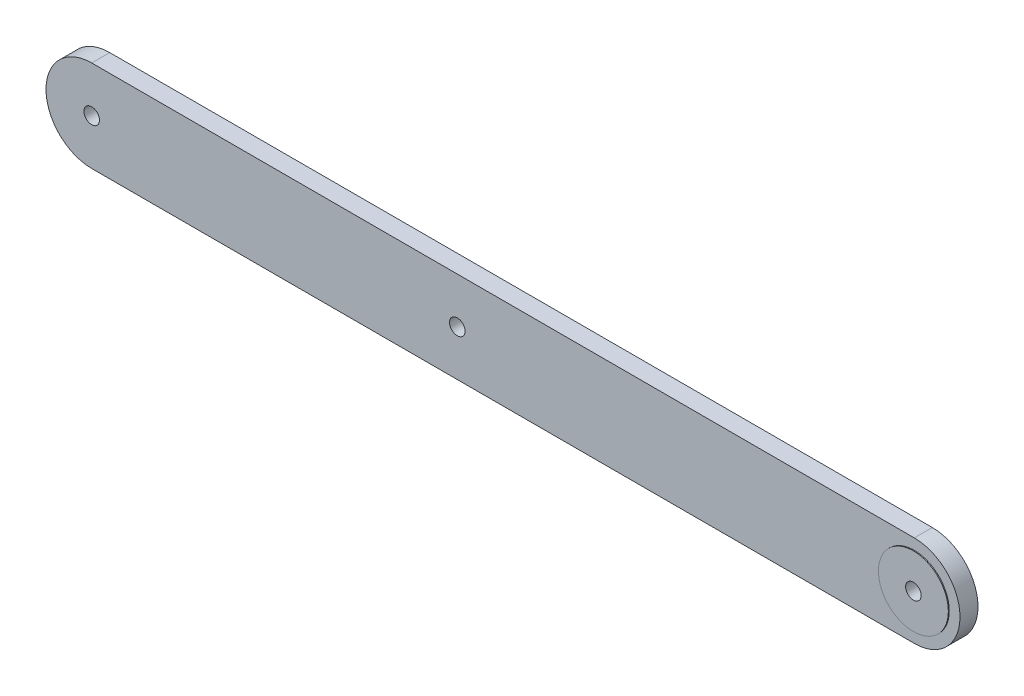
ISO-10303-21;
HEADER;
FILE_DESCRIPTION(('STEP AP214'),'2;1');
FILE_NAME('part.step','',(''),(''),'','','');
FILE_SCHEMA(('AUTOMOTIVE_DESIGN { 1 0 10303 214 1 1 1 1 }'));
ENDSEC;
DATA;
#1=APPLICATION_CONTEXT('core data for automotive mechanical design processes');
#2=APPLICATION_PROTOCOL_DEFINITION('international standard','automotive_design',2000,#1);
#3=PRODUCT_CONTEXT('',#1,'mechanical');
#4=PRODUCT('Part','Part','',(#3));
#5=PRODUCT_RELATED_PRODUCT_CATEGORY('part','',(#4));
#6=PRODUCT_DEFINITION_FORMATION('','',#4);
#7=PRODUCT_DEFINITION_CONTEXT('part definition',#1,'design');
#8=PRODUCT_DEFINITION('design','',#6,#7);
#9=PRODUCT_DEFINITION_SHAPE('','',#8);
#10=(LENGTH_UNIT() NAMED_UNIT(*) SI_UNIT(.MILLI.,.METRE.));
#11=(NAMED_UNIT(*) PLANE_ANGLE_UNIT() SI_UNIT($,.RADIAN.));
#12=(NAMED_UNIT(*) SI_UNIT($,.STERADIAN.) SOLID_ANGLE_UNIT());
#13=UNCERTAINTY_MEASURE_WITH_UNIT(LENGTH_MEASURE(1.E-05),#10,'distance_accuracy_value','');
#14=(GEOMETRIC_REPRESENTATION_CONTEXT(3) GLOBAL_UNCERTAINTY_ASSIGNED_CONTEXT((#13)) GLOBAL_UNIT_ASSIGNED_CONTEXT((#10,
#11,#12)) REPRESENTATION_CONTEXT('',''));
#15=CARTESIAN_POINT('',(0.,0.,0.));
#16=DIRECTION('',(0.,0.,1.));
#17=DIRECTION('',(1.,0.,0.));
#18=AXIS2_PLACEMENT_3D('',#15,#16,#17);
#19=CARTESIAN_POINT('',(-101.6,0.,5.0038));
#20=DIRECTION('',(0.,0.,-1.));
#21=DIRECTION('',(-1.,0.,0.));
#22=AXIS2_PLACEMENT_3D('',#19,#20,#21);
#23=CYLINDRICAL_SURFACE('',#22,12.7);
#24=CARTESIAN_POINT('',(-101.6,0.,0.));
#25=DIRECTION('',(0.,0.,1.));
#26=DIRECTION('',(1.,0.,0.));
#27=AXIS2_PLACEMENT_3D('',#24,#25,#26);
#28=CIRCLE('',#27,12.7);
#29=CARTESIAN_POINT('',(-101.6,-12.7,0.));
#30=VERTEX_POINT('',#29);
#31=CARTESIAN_POINT('',(-101.6,12.7,0.));
#32=VERTEX_POINT('',#31);
#33=EDGE_CURVE('E120',#30,#32,#28,.F.);
#34=ORIENTED_EDGE('',*,*,#33,.F.);
#35=DIRECTION('',(0.,0.,-1.));
#36=VECTOR('',#35,1.);
#37=CARTESIAN_POINT('',(-101.6,-12.7,5.0038));
#38=LINE('',#37,#36);
#39=CARTESIAN_POINT('',(-101.6,-12.7,5.0038));
#40=VERTEX_POINT('',#39);
#41=EDGE_CURVE('E12',#40,#30,#38,.T.);
#42=ORIENTED_EDGE('',*,*,#41,.F.);
#43=CARTESIAN_POINT('',(-101.6,0.,5.0038));
#44=DIRECTION('',(0.,0.,1.));
#45=DIRECTION('',(1.,0.,0.));
#46=AXIS2_PLACEMENT_3D('',#43,#44,#45);
#47=CIRCLE('',#46,12.7);
#48=CARTESIAN_POINT('',(-101.6,12.7,5.0038));
#49=VERTEX_POINT('',#48);
#50=EDGE_CURVE('E96',#40,#49,#47,.F.);
#51=ORIENTED_EDGE('',*,*,#50,.T.);
#52=DIRECTION('',(0.,0.,-1.));
#53=VECTOR('',#52,1.);
#54=CARTESIAN_POINT('',(-101.6,12.7,5.0038));
#55=LINE('',#54,#53);
#56=EDGE_CURVE('E63',#49,#32,#55,.T.);
#57=ORIENTED_EDGE('',*,*,#56,.T.);
#58=EDGE_LOOP('',(#34,#42,#51,#57));
#59=FACE_BOUND('',#58,.T.);
#60=ADVANCED_FACE('F44',(#59),#23,.T.);
#61=CARTESIAN_POINT('',(0.,-12.7,5.0038));
#62=DIRECTION('',(0.,1.,0.));
#63=DIRECTION('',(0.,0.,1.));
#64=AXIS2_PLACEMENT_3D('',#61,#62,#63);
#65=PLANE('',#64);
#66=DIRECTION('',(1.,0.,0.));
#67=VECTOR('',#66,1.);
#68=CARTESIAN_POINT('',(0.,-12.7,0.));
#69=LINE('',#68,#67);
#70=CARTESIAN_POINT('',(127.,-12.7,0.));
#71=VERTEX_POINT('',#70);
#72=EDGE_CURVE('E103',#30,#71,#69,.T.);
#73=ORIENTED_EDGE('',*,*,#72,.T.);
#74=DIRECTION('',(0.,0.,-1.));
#75=VECTOR('',#74,1.);
#76=CARTESIAN_POINT('',(127.,-12.7,5.0038));
#77=LINE('',#76,#75);
#78=CARTESIAN_POINT('',(127.,-12.7,5.0038));
#79=VERTEX_POINT('',#78);
#80=EDGE_CURVE('E55',#79,#71,#77,.T.);
#81=ORIENTED_EDGE('',*,*,#80,.F.);
#82=DIRECTION('',(1.,0.,0.));
#83=VECTOR('',#82,1.);
#84=CARTESIAN_POINT('',(0.,-12.7,5.0038));
#85=LINE('',#84,#83);
#86=EDGE_CURVE('E89',#40,#79,#85,.T.);
#87=ORIENTED_EDGE('',*,*,#86,.F.);
#88=ORIENTED_EDGE('',*,*,#41,.T.);
#89=EDGE_LOOP('',(#73,#81,#87,#88));
#90=FACE_BOUND('',#89,.T.);
#91=ADVANCED_FACE('F101',(#90),#65,.F.);
#92=CARTESIAN_POINT('',(127.,0.,5.0038));
#93=DIRECTION('',(0.,0.,-1.));
#94=DIRECTION('',(-1.,0.,0.));
#95=AXIS2_PLACEMENT_3D('',#92,#93,#94);
#96=CYLINDRICAL_SURFACE('',#95,12.7);
#97=CARTESIAN_POINT('',(127.,0.,0.));
#98=DIRECTION('',(0.,0.,1.));
#99=DIRECTION('',(1.,0.,0.));
#100=AXIS2_PLACEMENT_3D('',#97,#98,#99);
#101=CIRCLE('',#100,12.7);
#102=CARTESIAN_POINT('',(127.,12.7,0.));
#103=VERTEX_POINT('',#102);
#104=EDGE_CURVE('E127',#71,#103,#101,.T.);
#105=ORIENTED_EDGE('',*,*,#104,.T.);
#106=DIRECTION('',(0.,0.,-1.));
#107=VECTOR('',#106,1.);
#108=CARTESIAN_POINT('',(127.,12.7,5.0038));
#109=LINE('',#108,#107);
#110=CARTESIAN_POINT('',(127.,12.7,5.0038));
#111=VERTEX_POINT('',#110);
#112=EDGE_CURVE('E77',#111,#103,#109,.T.);
#113=ORIENTED_EDGE('',*,*,#112,.F.);
#114=CARTESIAN_POINT('',(127.,0.,5.0038));
#115=DIRECTION('',(0.,0.,1.));
#116=DIRECTION('',(1.,0.,0.));
#117=AXIS2_PLACEMENT_3D('',#114,#115,#116);
#118=CIRCLE('',#117,12.7);
#119=EDGE_CURVE('E95',#79,#111,#118,.T.);
#120=ORIENTED_EDGE('',*,*,#119,.F.);
#121=ORIENTED_EDGE('',*,*,#80,.T.);
#122=EDGE_LOOP('',(#105,#113,#120,#121));
#123=FACE_BOUND('',#122,.T.);
#124=ADVANCED_FACE('F108',(#123),#96,.T.);
#125=CARTESIAN_POINT('',(-101.6,-1.31188462870746E-12,5.0038));
#126=DIRECTION('',(0.,0.,-1.));
#127=DIRECTION('',(-1.,0.,0.));
#128=AXIS2_PLACEMENT_3D('',#125,#126,#127);
#129=CYLINDRICAL_SURFACE('',#128,2.15899999999999);
#130=CARTESIAN_POINT('',(-101.6,-1.31188462870746E-12,5.0038));
#131=DIRECTION('',(0.,0.,1.));
#132=DIRECTION('',(1.,0.,0.));
#133=AXIS2_PLACEMENT_3D('',#130,#131,#132);
#134=CIRCLE('',#133,2.15899999999999);
#135=CARTESIAN_POINT('',(-99.441,-1.31188462870746E-12,5.0038));
#136=VERTEX_POINT('',#135);
#137=EDGE_CURVE('E113',#136,#136,#134,.T.);
#138=ORIENTED_EDGE('',*,*,#137,.T.);
#139=EDGE_LOOP('',(#138));
#140=FACE_BOUND('',#139,.T.);
#141=CARTESIAN_POINT('',(-101.6,-1.31188462870746E-12,0.));
#142=DIRECTION('',(0.,0.,1.));
#143=DIRECTION('',(1.,0.,0.));
#144=AXIS2_PLACEMENT_3D('',#141,#142,#143);
#145=CIRCLE('',#144,2.15899999999999);
#146=CARTESIAN_POINT('',(-99.441,-1.31188462870746E-12,0.));
#147=VERTEX_POINT('',#146);
#148=EDGE_CURVE('E134',#147,#147,#145,.T.);
#149=ORIENTED_EDGE('',*,*,#148,.F.);
#150=EDGE_LOOP('',(#149));
#151=FACE_BOUND('',#150,.T.);
#152=ADVANCED_FACE('F158',(#140,#151),#129,.F.);
#153=CARTESIAN_POINT('',(0.,12.7,5.0038));
#154=DIRECTION('',(0.,1.,0.));
#155=DIRECTION('',(-1.,0.,0.));
#156=AXIS2_PLACEMENT_3D('',#153,#154,#155);
#157=PLANE('',#156);
#158=DIRECTION('',(1.,0.,0.));
#159=VECTOR('',#158,1.);
#160=CARTESIAN_POINT('',(0.,12.7,0.));
#161=LINE('',#160,#159);
#162=EDGE_CURVE('E139',#32,#103,#161,.T.);
#163=ORIENTED_EDGE('',*,*,#162,.F.);
#164=ORIENTED_EDGE('',*,*,#56,.F.);
#165=DIRECTION('',(1.,0.,0.));
#166=VECTOR('',#165,1.);
#167=CARTESIAN_POINT('',(0.,12.7,5.0038));
#168=LINE('',#167,#166);
#169=EDGE_CURVE('E110',#49,#111,#168,.T.);
#170=ORIENTED_EDGE('',*,*,#169,.T.);
#171=ORIENTED_EDGE('',*,*,#112,.T.);
#172=EDGE_LOOP('',(#163,#164,#170,#171));
#173=FACE_BOUND('',#172,.T.);
#174=ADVANCED_FACE('F161',(#173),#157,.T.);
#175=CARTESIAN_POINT('',(0.,0.,5.0038));
#176=DIRECTION('',(0.,0.,1.));
#177=DIRECTION('',(1.,0.,0.));
#178=AXIS2_PLACEMENT_3D('',#175,#176,#177);
#179=PLANE('',#178);
#180=CARTESIAN_POINT('',(0.,0.,5.0038));
#181=DIRECTION('',(0.,0.,1.));
#182=DIRECTION('',(1.,0.,0.));
#183=AXIS2_PLACEMENT_3D('',#180,#181,#182);
#184=CIRCLE('',#183,2.159);
#185=CARTESIAN_POINT('',(2.159,0.,5.0038));
#186=VERTEX_POINT('',#185);
#187=EDGE_CURVE('E193',#186,#186,#184,.T.);
#188=ORIENTED_EDGE('',*,*,#187,.F.);
#189=EDGE_LOOP('',(#188));
#190=FACE_BOUND('',#189,.T.);
#191=CARTESIAN_POINT('',(127.,0.,5.0038));
#192=DIRECTION('',(0.,0.,1.));
#193=DIRECTION('',(1.,0.,0.));
#194=AXIS2_PLACEMENT_3D('',#191,#192,#193);
#195=CIRCLE('',#194,9.71584369621803);
#196=CARTESIAN_POINT('',(136.715843696218,0.,5.0038));
#197=VERTEX_POINT('',#196);
#198=EDGE_CURVE('E123',#197,#197,#195,.F.);
#199=ORIENTED_EDGE('',*,*,#198,.T.);
#200=EDGE_LOOP('',(#199));
#201=FACE_BOUND('',#200,.T.);
#202=ORIENTED_EDGE('',*,*,#50,.F.);
#203=ORIENTED_EDGE('',*,*,#86,.T.);
#204=ORIENTED_EDGE('',*,*,#119,.T.);
#205=ORIENTED_EDGE('',*,*,#169,.F.);
#206=EDGE_LOOP('',(#202,#203,#204,#205));
#207=FACE_BOUND('',#206,.T.);
#208=ORIENTED_EDGE('',*,*,#137,.F.);
#209=EDGE_LOOP('',(#208));
#210=FACE_BOUND('',#209,.T.);
#211=ADVANCED_FACE('F91',(#190,#201,#207,#210),#179,.T.);
#212=CARTESIAN_POINT('',(0.,0.,0.));
#213=DIRECTION('',(0.,0.,1.));
#214=DIRECTION('',(1.,0.,0.));
#215=AXIS2_PLACEMENT_3D('',#212,#213,#214);
#216=PLANE('',#215);
#217=CARTESIAN_POINT('',(0.,0.,0.));
#218=DIRECTION('',(0.,0.,1.));
#219=DIRECTION('',(1.,0.,0.));
#220=AXIS2_PLACEMENT_3D('',#217,#218,#219);
#221=CIRCLE('',#220,2.159);
#222=CARTESIAN_POINT('',(2.159,0.,0.));
#223=VERTEX_POINT('',#222);
#224=EDGE_CURVE('E47',#223,#223,#221,.T.);
#225=ORIENTED_EDGE('',*,*,#224,.T.);
#226=EDGE_LOOP('',(#225));
#227=FACE_BOUND('',#226,.T.);
#228=ORIENTED_EDGE('',*,*,#33,.T.);
#229=ORIENTED_EDGE('',*,*,#162,.T.);
#230=ORIENTED_EDGE('',*,*,#104,.F.);
#231=ORIENTED_EDGE('',*,*,#72,.F.);
#232=EDGE_LOOP('',(#228,#229,#230,#231));
#233=FACE_BOUND('',#232,.T.);
#234=ORIENTED_EDGE('',*,*,#148,.T.);
#235=EDGE_LOOP('',(#234));
#236=FACE_BOUND('',#235,.T.);
#237=CARTESIAN_POINT('',(127.,0.,0.));
#238=DIRECTION('',(0.,0.,1.));
#239=DIRECTION('',(1.,0.,0.));
#240=AXIS2_PLACEMENT_3D('',#237,#238,#239);
#241=CIRCLE('',#240,2.15899999999999);
#242=CARTESIAN_POINT('',(129.159,0.,0.));
#243=VERTEX_POINT('',#242);
#244=EDGE_CURVE('E197',#243,#243,#241,.T.);
#245=ORIENTED_EDGE('',*,*,#244,.T.);
#246=EDGE_LOOP('',(#245));
#247=FACE_BOUND('',#246,.T.);
#248=ADVANCED_FACE('F149',(#227,#233,#236,#247),#216,.F.);
#249=CARTESIAN_POINT('',(127.,0.,5.2578));
#250=DIRECTION('',(0.,0.,1.));
#251=DIRECTION('',(1.,0.,0.));
#252=AXIS2_PLACEMENT_3D('',#249,#250,#251);
#253=PLANE('',#252);
#254=CARTESIAN_POINT('',(127.,0.,5.2578));
#255=DIRECTION('',(0.,0.,1.));
#256=DIRECTION('',(1.,0.,0.));
#257=AXIS2_PLACEMENT_3D('',#254,#255,#256);
#258=CIRCLE('',#257,9.71584369621803);
#259=CARTESIAN_POINT('',(136.715843696218,0.,5.2578));
#260=VERTEX_POINT('',#259);
#261=EDGE_CURVE('E208',#260,#260,#258,.T.);
#262=ORIENTED_EDGE('',*,*,#261,.T.);
#263=EDGE_LOOP('',(#262));
#264=FACE_BOUND('',#263,.T.);
#265=CARTESIAN_POINT('',(127.,0.,5.2578));
#266=DIRECTION('',(0.,0.,1.));
#267=DIRECTION('',(1.,0.,0.));
#268=AXIS2_PLACEMENT_3D('',#265,#266,#267);
#269=CIRCLE('',#268,2.15899999999999);
#270=CARTESIAN_POINT('',(129.159,0.,5.2578));
#271=VERTEX_POINT('',#270);
#272=EDGE_CURVE('E201',#271,#271,#269,.T.);
#273=ORIENTED_EDGE('',*,*,#272,.F.);
#274=EDGE_LOOP('',(#273));
#275=FACE_BOUND('',#274,.T.);
#276=ADVANCED_FACE('F169',(#264,#275),#253,.T.);
#277=CARTESIAN_POINT('',(127.,0.,5.2578));
#278=DIRECTION('',(0.,0.,-1.));
#279=DIRECTION('',(-1.,0.,0.));
#280=AXIS2_PLACEMENT_3D('',#277,#278,#279);
#281=CYLINDRICAL_SURFACE('',#280,9.71584369621803);
#282=ORIENTED_EDGE('',*,*,#198,.F.);
#283=EDGE_LOOP('',(#282));
#284=FACE_BOUND('',#283,.T.);
#285=ORIENTED_EDGE('',*,*,#261,.F.);
#286=EDGE_LOOP('',(#285));
#287=FACE_BOUND('',#286,.T.);
#288=ADVANCED_FACE('F174',(#284,#287),#281,.T.);
#289=CARTESIAN_POINT('',(127.,0.,5.2578));
#290=DIRECTION('',(0.,0.,-1.));
#291=DIRECTION('',(-1.,0.,0.));
#292=AXIS2_PLACEMENT_3D('',#289,#290,#291);
#293=CYLINDRICAL_SURFACE('',#292,2.15899999999999);
#294=ORIENTED_EDGE('',*,*,#272,.T.);
#295=EDGE_LOOP('',(#294));
#296=FACE_BOUND('',#295,.T.);
#297=ORIENTED_EDGE('',*,*,#244,.F.);
#298=EDGE_LOOP('',(#297));
#299=FACE_BOUND('',#298,.T.);
#300=ADVANCED_FACE('F177',(#296,#299),#293,.F.);
#301=CARTESIAN_POINT('',(0.,0.,-14.8082));
#302=DIRECTION('',(0.,0.,1.));
#303=DIRECTION('',(1.,0.,0.));
#304=AXIS2_PLACEMENT_3D('',#301,#302,#303);
#305=CYLINDRICAL_SURFACE('',#304,2.159);
#306=ORIENTED_EDGE('',*,*,#187,.T.);
#307=EDGE_LOOP('',(#306));
#308=FACE_BOUND('',#307,.T.);
#309=ORIENTED_EDGE('',*,*,#224,.F.);
#310=EDGE_LOOP('',(#309));
#311=FACE_BOUND('',#310,.T.);
#312=ADVANCED_FACE('F184',(#308,#311),#305,.F.);
#313=CLOSED_SHELL('',(#60,#91,#124,#152,#174,#211,#248,#276,#288,#300,#312));
#314=MANIFOLD_SOLID_BREP('B2',#313);
#315=ADVANCED_BREP_SHAPE_REPRESENTATION('',(#18,#314),#14);
#316=SHAPE_DEFINITION_REPRESENTATION(#9,#315);
ENDSEC;
END-ISO-10303-21;
